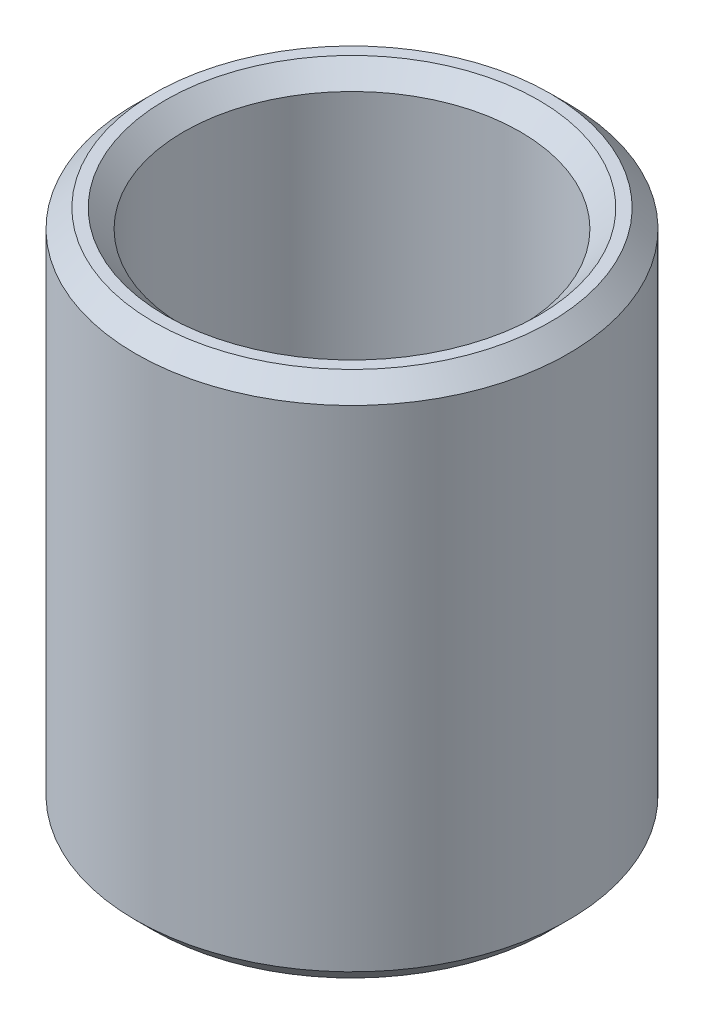
ISO-10303-21;
HEADER;
FILE_DESCRIPTION(('STEP AP214'),'2;1');
FILE_NAME('part.step','',(''),(''),'','','');
FILE_SCHEMA(('AUTOMOTIVE_DESIGN { 1 0 10303 214 1 1 1 1 }'));
ENDSEC;
DATA;
#1=APPLICATION_CONTEXT('core data for automotive mechanical design processes');
#2=APPLICATION_PROTOCOL_DEFINITION('international standard','automotive_design',2000,#1);
#3=PRODUCT_CONTEXT('',#1,'mechanical');
#4=PRODUCT('Part','Part','',(#3));
#5=PRODUCT_RELATED_PRODUCT_CATEGORY('part','',(#4));
#6=PRODUCT_DEFINITION_FORMATION('','',#4);
#7=PRODUCT_DEFINITION_CONTEXT('part definition',#1,'design');
#8=PRODUCT_DEFINITION('design','',#6,#7);
#9=PRODUCT_DEFINITION_SHAPE('','',#8);
#10=(LENGTH_UNIT() NAMED_UNIT(*) SI_UNIT(.MILLI.,.METRE.));
#11=(NAMED_UNIT(*) PLANE_ANGLE_UNIT() SI_UNIT($,.RADIAN.));
#12=(NAMED_UNIT(*) SI_UNIT($,.STERADIAN.) SOLID_ANGLE_UNIT());
#13=UNCERTAINTY_MEASURE_WITH_UNIT(LENGTH_MEASURE(1.E-05),#10,'distance_accuracy_value','');
#14=(GEOMETRIC_REPRESENTATION_CONTEXT(3) GLOBAL_UNCERTAINTY_ASSIGNED_CONTEXT((#13)) GLOBAL_UNIT_ASSIGNED_CONTEXT((#10,
#11,#12)) REPRESENTATION_CONTEXT('',''));
#15=CARTESIAN_POINT('',(0.,0.,0.));
#16=DIRECTION('',(0.,0.,1.));
#17=DIRECTION('',(1.,0.,0.));
#18=AXIS2_PLACEMENT_3D('',#15,#16,#17);
#19=CARTESIAN_POINT('',(0.,103.510891805294,0.));
#20=DIRECTION('',(0.,-1.,0.));
#21=DIRECTION('',(0.,0.,-1.));
#22=AXIS2_PLACEMENT_3D('',#19,#20,#21);
#23=CYLINDRICAL_SURFACE('',#22,42.5);
#24=CARTESIAN_POINT('',(0.,3.59136171721591,0.));
#25=DIRECTION('',(0.,1.,0.));
#26=DIRECTION('',(0.,0.,1.));
#27=AXIS2_PLACEMENT_3D('',#24,#25,#26);
#28=CIRCLE('',#27,42.5);
#29=CARTESIAN_POINT('',(0.,3.59136171721591,42.5));
#30=VERTEX_POINT('',#29);
#31=EDGE_CURVE('E10',#30,#30,#28,.T.);
#32=ORIENTED_EDGE('',*,*,#31,.T.);
#33=EDGE_LOOP('',(#32));
#34=FACE_BOUND('',#33,.T.);
#35=CARTESIAN_POINT('',(0.,99.919530088078,0.));
#36=DIRECTION('',(0.,1.,0.));
#37=DIRECTION('',(0.,0.,1.));
#38=AXIS2_PLACEMENT_3D('',#35,#36,#37);
#39=CIRCLE('',#38,42.5);
#40=CARTESIAN_POINT('',(0.,99.919530088078,42.5));
#41=VERTEX_POINT('',#40);
#42=EDGE_CURVE('E50',#41,#41,#39,.F.);
#43=ORIENTED_EDGE('',*,*,#42,.T.);
#44=EDGE_LOOP('',(#43));
#45=FACE_BOUND('',#44,.T.);
#46=ADVANCED_FACE('F39',(#34,#45),#23,.T.);
#47=CARTESIAN_POINT('',(0.,103.510891805294,0.));
#48=DIRECTION('',(0.,1.,0.));
#49=DIRECTION('',(0.,0.,1.));
#50=AXIS2_PLACEMENT_3D('',#47,#48,#49);
#51=PLANE('',#50);
#52=CARTESIAN_POINT('',(0.,103.510891805294,0.));
#53=DIRECTION('',(0.,1.,0.));
#54=DIRECTION('',(0.,0.,1.));
#55=AXIS2_PLACEMENT_3D('',#52,#53,#54);
#56=CIRCLE('',#55,36.6371935321455);
#57=CARTESIAN_POINT('',(0.,103.510891805294,36.6371935321455));
#58=VERTEX_POINT('',#57);
#59=EDGE_CURVE('E58',#58,#58,#56,.F.);
#60=ORIENTED_EDGE('',*,*,#59,.T.);
#61=EDGE_LOOP('',(#60));
#62=FACE_BOUND('',#61,.T.);
#63=CARTESIAN_POINT('',(0.,103.510891805294,0.));
#64=DIRECTION('',(0.,1.,0.));
#65=DIRECTION('',(0.,0.,1.));
#66=AXIS2_PLACEMENT_3D('',#63,#64,#65);
#67=CIRCLE('',#66,38.9086382827841);
#68=CARTESIAN_POINT('',(0.,103.510891805294,38.9086382827841));
#69=VERTEX_POINT('',#68);
#70=EDGE_CURVE('E61',#69,#69,#67,.T.);
#71=ORIENTED_EDGE('',*,*,#70,.T.);
#72=EDGE_LOOP('',(#71));
#73=FACE_BOUND('',#72,.T.);
#74=ADVANCED_FACE('F88',(#62,#73),#51,.T.);
#75=CARTESIAN_POINT('',(0.,0.,0.));
#76=DIRECTION('',(0.,1.,0.));
#77=DIRECTION('',(0.,0.,1.));
#78=AXIS2_PLACEMENT_3D('',#75,#76,#77);
#79=PLANE('',#78);
#80=CARTESIAN_POINT('',(0.,0.,0.));
#81=DIRECTION('',(0.,1.,0.));
#82=DIRECTION('',(0.,0.,1.));
#83=AXIS2_PLACEMENT_3D('',#80,#81,#82);
#84=CIRCLE('',#83,36.6371935321455);
#85=CARTESIAN_POINT('',(0.,0.,36.6371935321455));
#86=VERTEX_POINT('',#85);
#87=EDGE_CURVE('E51',#86,#86,#84,.T.);
#88=ORIENTED_EDGE('',*,*,#87,.T.);
#89=EDGE_LOOP('',(#88));
#90=FACE_BOUND('',#89,.T.);
#91=CARTESIAN_POINT('',(0.,0.,0.));
#92=DIRECTION('',(0.,1.,0.));
#93=DIRECTION('',(0.,0.,1.));
#94=AXIS2_PLACEMENT_3D('',#91,#92,#93);
#95=CIRCLE('',#94,38.9086382827841);
#96=CARTESIAN_POINT('',(0.,0.,38.9086382827841));
#97=VERTEX_POINT('',#96);
#98=EDGE_CURVE('E54',#97,#97,#95,.F.);
#99=ORIENTED_EDGE('',*,*,#98,.T.);
#100=EDGE_LOOP('',(#99));
#101=FACE_BOUND('',#100,.T.);
#102=ADVANCED_FACE('F83',(#90,#101),#79,.F.);
#103=CARTESIAN_POINT('',(0.,103.510891805294,0.));
#104=DIRECTION('',(0.,-1.,0.));
#105=DIRECTION('',(0.,0.,-1.));
#106=AXIS2_PLACEMENT_3D('',#103,#104,#105);
#107=CYLINDRICAL_SURFACE('',#106,33.0458318149296);
#108=CARTESIAN_POINT('',(0.,99.919530088078,0.));
#109=DIRECTION('',(0.,1.,0.));
#110=DIRECTION('',(0.,0.,1.));
#111=AXIS2_PLACEMENT_3D('',#108,#109,#110);
#112=CIRCLE('',#111,33.0458318149296);
#113=CARTESIAN_POINT('',(0.,99.919530088078,33.0458318149296));
#114=VERTEX_POINT('',#113);
#115=EDGE_CURVE('E67',#114,#114,#112,.T.);
#116=ORIENTED_EDGE('',*,*,#115,.T.);
#117=EDGE_LOOP('',(#116));
#118=FACE_BOUND('',#117,.T.);
#119=CARTESIAN_POINT('',(0.,3.59136171721595,0.));
#120=DIRECTION('',(0.,1.,0.));
#121=DIRECTION('',(0.,0.,1.));
#122=AXIS2_PLACEMENT_3D('',#119,#120,#121);
#123=CIRCLE('',#122,33.0458318149296);
#124=CARTESIAN_POINT('',(0.,3.59136171721595,33.0458318149296));
#125=VERTEX_POINT('',#124);
#126=EDGE_CURVE('E69',#125,#125,#123,.F.);
#127=ORIENTED_EDGE('',*,*,#126,.T.);
#128=EDGE_LOOP('',(#127));
#129=FACE_BOUND('',#128,.T.);
#130=ADVANCED_FACE('F71',(#118,#129),#107,.F.);
#131=CARTESIAN_POINT('',(0.,99.919530088078,0.));
#132=DIRECTION('',(0.,1.,0.));
#133=DIRECTION('',(0.,0.,1.));
#134=AXIS2_PLACEMENT_3D('',#131,#132,#133);
#135=CONICAL_SURFACE('',#134,33.0458318149296,0.785398163397455);
#136=ORIENTED_EDGE('',*,*,#59,.F.);
#137=EDGE_LOOP('',(#136));
#138=FACE_BOUND('',#137,.T.);
#139=ORIENTED_EDGE('',*,*,#115,.F.);
#140=EDGE_LOOP('',(#139));
#141=FACE_BOUND('',#140,.T.);
#142=ADVANCED_FACE('F77',(#138,#141),#135,.F.);
#143=CARTESIAN_POINT('',(0.,0.,0.));
#144=DIRECTION('',(0.,-1.,0.));
#145=DIRECTION('',(0.,0.,-1.));
#146=AXIS2_PLACEMENT_3D('',#143,#144,#145);
#147=CONICAL_SURFACE('',#146,36.6371935321455,0.785398163397444);
#148=ORIENTED_EDGE('',*,*,#126,.F.);
#149=EDGE_LOOP('',(#148));
#150=FACE_BOUND('',#149,.T.);
#151=ORIENTED_EDGE('',*,*,#87,.F.);
#152=EDGE_LOOP('',(#151));
#153=FACE_BOUND('',#152,.T.);
#154=ADVANCED_FACE('F73',(#150,#153),#147,.F.);
#155=CARTESIAN_POINT('',(0.,3.59136171721591,0.));
#156=DIRECTION('',(0.,1.,0.));
#157=DIRECTION('',(0.,0.,1.));
#158=AXIS2_PLACEMENT_3D('',#155,#156,#157);
#159=CONICAL_SURFACE('',#158,42.5,0.785398163397452);
#160=ORIENTED_EDGE('',*,*,#98,.F.);
#161=EDGE_LOOP('',(#160));
#162=FACE_BOUND('',#161,.T.);
#163=ORIENTED_EDGE('',*,*,#31,.F.);
#164=EDGE_LOOP('',(#163));
#165=FACE_BOUND('',#164,.T.);
#166=ADVANCED_FACE('F76',(#162,#165),#159,.T.);
#167=CARTESIAN_POINT('',(0.,103.510891805294,0.));
#168=DIRECTION('',(0.,-1.,0.));
#169=DIRECTION('',(0.,0.,-1.));
#170=AXIS2_PLACEMENT_3D('',#167,#168,#169);
#171=CONICAL_SURFACE('',#170,38.9086382827841,0.785398163397444);
#172=ORIENTED_EDGE('',*,*,#42,.F.);
#173=EDGE_LOOP('',(#172));
#174=FACE_BOUND('',#173,.T.);
#175=ORIENTED_EDGE('',*,*,#70,.F.);
#176=EDGE_LOOP('',(#175));
#177=FACE_BOUND('',#176,.T.);
#178=ADVANCED_FACE('F45',(#174,#177),#171,.T.);
#179=CLOSED_SHELL('',(#46,#74,#102,#130,#142,#154,#166,#178));
#180=MANIFOLD_SOLID_BREP('B2',#179);
#181=ADVANCED_BREP_SHAPE_REPRESENTATION('',(#18,#180),#14);
#182=SHAPE_DEFINITION_REPRESENTATION(#9,#181);
ENDSEC;
END-ISO-10303-21;
